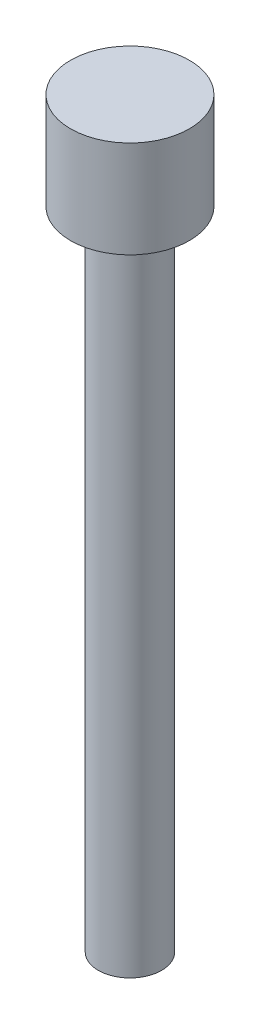
ISO-10303-21;
HEADER;
FILE_DESCRIPTION(('STEP AP214'),'2;1');
FILE_NAME('part.step','',(''),(''),'','','');
FILE_SCHEMA(('AUTOMOTIVE_DESIGN { 1 0 10303 214 1 1 1 1 }'));
ENDSEC;
DATA;
#1=APPLICATION_CONTEXT('core data for automotive mechanical design processes');
#2=APPLICATION_PROTOCOL_DEFINITION('international standard','automotive_design',2000,#1);
#3=PRODUCT_CONTEXT('',#1,'mechanical');
#4=PRODUCT('Part','Part','',(#3));
#5=PRODUCT_RELATED_PRODUCT_CATEGORY('part','',(#4));
#6=PRODUCT_DEFINITION_FORMATION('','',#4);
#7=PRODUCT_DEFINITION_CONTEXT('part definition',#1,'design');
#8=PRODUCT_DEFINITION('design','',#6,#7);
#9=PRODUCT_DEFINITION_SHAPE('','',#8);
#10=(LENGTH_UNIT() NAMED_UNIT(*) SI_UNIT(.MILLI.,.METRE.));
#11=(NAMED_UNIT(*) PLANE_ANGLE_UNIT() SI_UNIT($,.RADIAN.));
#12=(NAMED_UNIT(*) SI_UNIT($,.STERADIAN.) SOLID_ANGLE_UNIT());
#13=UNCERTAINTY_MEASURE_WITH_UNIT(LENGTH_MEASURE(1.E-05),#10,'distance_accuracy_value','');
#14=(GEOMETRIC_REPRESENTATION_CONTEXT(3) GLOBAL_UNCERTAINTY_ASSIGNED_CONTEXT((#13)) GLOBAL_UNIT_ASSIGNED_CONTEXT((#10,
#11,#12)) REPRESENTATION_CONTEXT('',''));
#15=CARTESIAN_POINT('',(0.,0.,0.));
#16=DIRECTION('',(0.,0.,1.));
#17=DIRECTION('',(1.,0.,0.));
#18=AXIS2_PLACEMENT_3D('',#15,#16,#17);
#19=CARTESIAN_POINT('',(0.,3.,0.));
#20=DIRECTION('',(0.,-1.,0.));
#21=DIRECTION('',(0.,0.,-1.));
#22=AXIS2_PLACEMENT_3D('',#19,#20,#21);
#23=CYLINDRICAL_SURFACE('',#22,1.84);
#24=CARTESIAN_POINT('',(0.,3.,0.));
#25=DIRECTION('',(0.,1.,0.));
#26=DIRECTION('',(0.,0.,1.));
#27=AXIS2_PLACEMENT_3D('',#24,#25,#26);
#28=CIRCLE('',#27,1.84);
#29=CARTESIAN_POINT('',(0.,3.,1.84));
#30=VERTEX_POINT('',#29);
#31=EDGE_CURVE('E45',#30,#30,#28,.T.);
#32=ORIENTED_EDGE('',*,*,#31,.F.);
#33=EDGE_LOOP('',(#32));
#34=FACE_BOUND('',#33,.T.);
#35=CARTESIAN_POINT('',(0.,0.,0.));
#36=DIRECTION('',(0.,1.,0.));
#37=DIRECTION('',(0.,0.,1.));
#38=AXIS2_PLACEMENT_3D('',#35,#36,#37);
#39=CIRCLE('',#38,1.84);
#40=CARTESIAN_POINT('',(0.,0.,1.84));
#41=VERTEX_POINT('',#40);
#42=EDGE_CURVE('E40',#41,#41,#39,.T.);
#43=ORIENTED_EDGE('',*,*,#42,.T.);
#44=EDGE_LOOP('',(#43));
#45=FACE_BOUND('',#44,.T.);
#46=ADVANCED_FACE('F37',(#34,#45),#23,.T.);
#47=CARTESIAN_POINT('',(0.,3.,0.));
#48=DIRECTION('',(0.,1.,0.));
#49=DIRECTION('',(0.,0.,1.));
#50=AXIS2_PLACEMENT_3D('',#47,#48,#49);
#51=PLANE('',#50);
#52=ORIENTED_EDGE('',*,*,#31,.T.);
#53=EDGE_LOOP('',(#52));
#54=FACE_BOUND('',#53,.T.);
#55=ADVANCED_FACE('F65',(#54),#51,.T.);
#56=CARTESIAN_POINT('',(0.,0.,0.));
#57=DIRECTION('',(0.,1.,0.));
#58=DIRECTION('',(0.,0.,1.));
#59=AXIS2_PLACEMENT_3D('',#56,#57,#58);
#60=PLANE('',#59);
#61=CARTESIAN_POINT('',(0.,0.,0.));
#62=DIRECTION('',(0.,-1.,0.));
#63=DIRECTION('',(0.,0.,-1.));
#64=AXIS2_PLACEMENT_3D('',#61,#62,#63);
#65=CIRCLE('',#64,0.98);
#66=CARTESIAN_POINT('',(0.,0.,-0.98));
#67=VERTEX_POINT('',#66);
#68=EDGE_CURVE('E10',#67,#67,#65,.T.);
#69=ORIENTED_EDGE('',*,*,#68,.F.);
#70=EDGE_LOOP('',(#69));
#71=FACE_BOUND('',#70,.T.);
#72=ORIENTED_EDGE('',*,*,#42,.F.);
#73=EDGE_LOOP('',(#72));
#74=FACE_BOUND('',#73,.T.);
#75=ADVANCED_FACE('F62',(#71,#74),#60,.F.);
#76=CARTESIAN_POINT('',(0.,-20.,0.));
#77=DIRECTION('',(0.,1.,0.));
#78=DIRECTION('',(0.,0.,1.));
#79=AXIS2_PLACEMENT_3D('',#76,#77,#78);
#80=CYLINDRICAL_SURFACE('',#79,0.98);
#81=CARTESIAN_POINT('',(0.,-20.,0.));
#82=DIRECTION('',(0.,-1.,0.));
#83=DIRECTION('',(0.,0.,-1.));
#84=AXIS2_PLACEMENT_3D('',#81,#82,#83);
#85=CIRCLE('',#84,0.98);
#86=CARTESIAN_POINT('',(0.,-20.,-0.98));
#87=VERTEX_POINT('',#86);
#88=EDGE_CURVE('E52',#87,#87,#85,.T.);
#89=ORIENTED_EDGE('',*,*,#88,.F.);
#90=EDGE_LOOP('',(#89));
#91=FACE_BOUND('',#90,.T.);
#92=ORIENTED_EDGE('',*,*,#68,.T.);
#93=EDGE_LOOP('',(#92));
#94=FACE_BOUND('',#93,.T.);
#95=ADVANCED_FACE('F64',(#91,#94),#80,.T.);
#96=CARTESIAN_POINT('',(0.,-20.,0.));
#97=DIRECTION('',(0.,-1.,0.));
#98=DIRECTION('',(0.,0.,-1.));
#99=AXIS2_PLACEMENT_3D('',#96,#97,#98);
#100=PLANE('',#99);
#101=ORIENTED_EDGE('',*,*,#88,.T.);
#102=EDGE_LOOP('',(#101));
#103=FACE_BOUND('',#102,.T.);
#104=ADVANCED_FACE('F71',(#103),#100,.T.);
#105=CLOSED_SHELL('',(#46,#55,#75,#95,#104));
#106=MANIFOLD_SOLID_BREP('B2',#105);
#107=ADVANCED_BREP_SHAPE_REPRESENTATION('',(#18,#106),#14);
#108=SHAPE_DEFINITION_REPRESENTATION(#9,#107);
ENDSEC;
END-ISO-10303-21;
